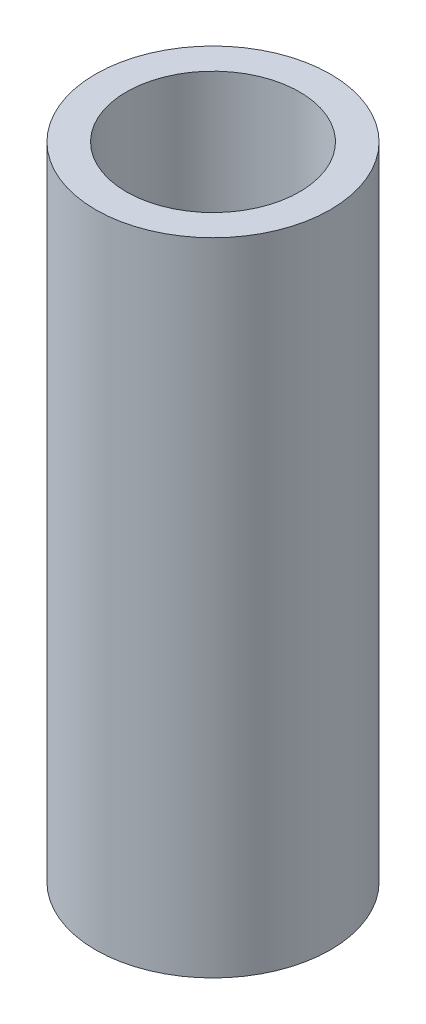
ISO-10303-21;
HEADER;
FILE_DESCRIPTION(('STEP AP214'),'2;1');
FILE_NAME('part.step','',(''),(''),'','','');
FILE_SCHEMA(('AUTOMOTIVE_DESIGN { 1 0 10303 214 1 1 1 1 }'));
ENDSEC;
DATA;
#1=APPLICATION_CONTEXT('core data for automotive mechanical design processes');
#2=APPLICATION_PROTOCOL_DEFINITION('international standard','automotive_design',2000,#1);
#3=PRODUCT_CONTEXT('',#1,'mechanical');
#4=PRODUCT('Part','Part','',(#3));
#5=PRODUCT_RELATED_PRODUCT_CATEGORY('part','',(#4));
#6=PRODUCT_DEFINITION_FORMATION('','',#4);
#7=PRODUCT_DEFINITION_CONTEXT('part definition',#1,'design');
#8=PRODUCT_DEFINITION('design','',#6,#7);
#9=PRODUCT_DEFINITION_SHAPE('','',#8);
#10=(LENGTH_UNIT() NAMED_UNIT(*) SI_UNIT(.MILLI.,.METRE.));
#11=(NAMED_UNIT(*) PLANE_ANGLE_UNIT() SI_UNIT($,.RADIAN.));
#12=(NAMED_UNIT(*) SI_UNIT($,.STERADIAN.) SOLID_ANGLE_UNIT());
#13=UNCERTAINTY_MEASURE_WITH_UNIT(LENGTH_MEASURE(1.E-05),#10,'distance_accuracy_value','');
#14=(GEOMETRIC_REPRESENTATION_CONTEXT(3) GLOBAL_UNCERTAINTY_ASSIGNED_CONTEXT((#13)) GLOBAL_UNIT_ASSIGNED_CONTEXT((#10,
#11,#12)) REPRESENTATION_CONTEXT('',''));
#15=CARTESIAN_POINT('',(0.,0.,0.));
#16=DIRECTION('',(0.,0.,1.));
#17=DIRECTION('',(1.,0.,0.));
#18=AXIS2_PLACEMENT_3D('',#15,#16,#17);
#19=CARTESIAN_POINT('',(0.,95.5359797632939,0.));
#20=DIRECTION('',(0.,-1.,0.));
#21=DIRECTION('',(0.,0.,-1.));
#22=AXIS2_PLACEMENT_3D('',#19,#20,#21);
#23=CYLINDRICAL_SURFACE('',#22,17.5);
#24=CARTESIAN_POINT('',(0.,95.5359797632939,0.));
#25=DIRECTION('',(0.,1.,0.));
#26=DIRECTION('',(0.,0.,1.));
#27=AXIS2_PLACEMENT_3D('',#24,#25,#26);
#28=CIRCLE('',#27,17.5);
#29=CARTESIAN_POINT('',(0.,95.5359797632939,17.5));
#30=VERTEX_POINT('',#29);
#31=EDGE_CURVE('E10',#30,#30,#28,.T.);
#32=ORIENTED_EDGE('',*,*,#31,.F.);
#33=EDGE_LOOP('',(#32));
#34=FACE_BOUND('',#33,.T.);
#35=CARTESIAN_POINT('',(0.,0.,0.));
#36=DIRECTION('',(0.,1.,0.));
#37=DIRECTION('',(0.,0.,1.));
#38=AXIS2_PLACEMENT_3D('',#35,#36,#37);
#39=CIRCLE('',#38,17.5);
#40=CARTESIAN_POINT('',(0.,0.,17.5));
#41=VERTEX_POINT('',#40);
#42=EDGE_CURVE('E37',#41,#41,#39,.T.);
#43=ORIENTED_EDGE('',*,*,#42,.T.);
#44=EDGE_LOOP('',(#43));
#45=FACE_BOUND('',#44,.T.);
#46=ADVANCED_FACE('F40',(#34,#45),#23,.T.);
#47=CARTESIAN_POINT('',(0.,95.5359797632939,0.));
#48=DIRECTION('',(0.,1.,0.));
#49=DIRECTION('',(0.,0.,1.));
#50=AXIS2_PLACEMENT_3D('',#47,#48,#49);
#51=PLANE('',#50);
#52=CARTESIAN_POINT('',(0.,95.5359797632939,0.));
#53=DIRECTION('',(0.,1.,0.));
#54=DIRECTION('',(0.,0.,1.));
#55=AXIS2_PLACEMENT_3D('',#52,#53,#54);
#56=CIRCLE('',#55,12.9085181310041);
#57=CARTESIAN_POINT('',(0.,95.5359797632939,12.9085181310041));
#58=VERTEX_POINT('',#57);
#59=EDGE_CURVE('E50',#58,#58,#56,.T.);
#60=ORIENTED_EDGE('',*,*,#59,.F.);
#61=EDGE_LOOP('',(#60));
#62=FACE_BOUND('',#61,.T.);
#63=ORIENTED_EDGE('',*,*,#31,.T.);
#64=EDGE_LOOP('',(#63));
#65=FACE_BOUND('',#64,.T.);
#66=ADVANCED_FACE('F59',(#62,#65),#51,.T.);
#67=CARTESIAN_POINT('',(0.,0.,0.));
#68=DIRECTION('',(0.,1.,0.));
#69=DIRECTION('',(0.,0.,1.));
#70=AXIS2_PLACEMENT_3D('',#67,#68,#69);
#71=PLANE('',#70);
#72=CARTESIAN_POINT('',(0.,0.,0.));
#73=DIRECTION('',(0.,1.,0.));
#74=DIRECTION('',(0.,0.,1.));
#75=AXIS2_PLACEMENT_3D('',#72,#73,#74);
#76=CIRCLE('',#75,12.9085181310041);
#77=CARTESIAN_POINT('',(0.,0.,12.9085181310041));
#78=VERTEX_POINT('',#77);
#79=EDGE_CURVE('E47',#78,#78,#76,.T.);
#80=ORIENTED_EDGE('',*,*,#79,.T.);
#81=EDGE_LOOP('',(#80));
#82=FACE_BOUND('',#81,.T.);
#83=ORIENTED_EDGE('',*,*,#42,.F.);
#84=EDGE_LOOP('',(#83));
#85=FACE_BOUND('',#84,.T.);
#86=ADVANCED_FACE('F58',(#82,#85),#71,.F.);
#87=CARTESIAN_POINT('',(0.,95.5359797632939,0.));
#88=DIRECTION('',(0.,-1.,0.));
#89=DIRECTION('',(0.,0.,-1.));
#90=AXIS2_PLACEMENT_3D('',#87,#88,#89);
#91=CYLINDRICAL_SURFACE('',#90,12.9085181310041);
#92=ORIENTED_EDGE('',*,*,#59,.T.);
#93=EDGE_LOOP('',(#92));
#94=FACE_BOUND('',#93,.T.);
#95=ORIENTED_EDGE('',*,*,#79,.F.);
#96=EDGE_LOOP('',(#95));
#97=FACE_BOUND('',#96,.T.);
#98=ADVANCED_FACE('F54',(#94,#97),#91,.F.);
#99=CLOSED_SHELL('',(#46,#66,#86,#98));
#100=MANIFOLD_SOLID_BREP('B2',#99);
#101=ADVANCED_BREP_SHAPE_REPRESENTATION('',(#18,#100),#14);
#102=SHAPE_DEFINITION_REPRESENTATION(#9,#101);
ENDSEC;
END-ISO-10303-21;
